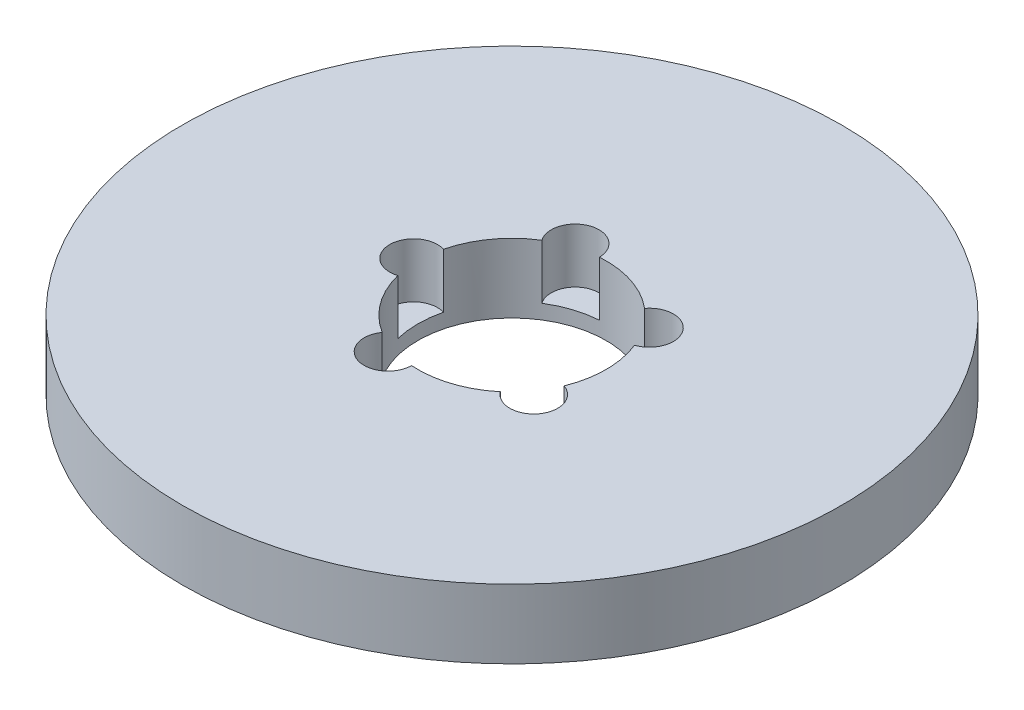
ISO-10303-21;
HEADER;
FILE_DESCRIPTION(('STEP AP214'),'2;1');
FILE_NAME('part.step','',(''),(''),'','','');
FILE_SCHEMA(('AUTOMOTIVE_DESIGN { 1 0 10303 214 1 1 1 1 }'));
ENDSEC;
DATA;
#1=APPLICATION_CONTEXT('core data for automotive mechanical design processes');
#2=APPLICATION_PROTOCOL_DEFINITION('international standard','automotive_design',2000,#1);
#3=PRODUCT_CONTEXT('',#1,'mechanical');
#4=PRODUCT('Part','Part','',(#3));
#5=PRODUCT_RELATED_PRODUCT_CATEGORY('part','',(#4));
#6=PRODUCT_DEFINITION_FORMATION('','',#4);
#7=PRODUCT_DEFINITION_CONTEXT('part definition',#1,'design');
#8=PRODUCT_DEFINITION('design','',#6,#7);
#9=PRODUCT_DEFINITION_SHAPE('','',#8);
#10=(LENGTH_UNIT() NAMED_UNIT(*) SI_UNIT(.MILLI.,.METRE.));
#11=(NAMED_UNIT(*) PLANE_ANGLE_UNIT() SI_UNIT($,.RADIAN.));
#12=(NAMED_UNIT(*) SI_UNIT($,.STERADIAN.) SOLID_ANGLE_UNIT());
#13=UNCERTAINTY_MEASURE_WITH_UNIT(LENGTH_MEASURE(1.E-05),#10,'distance_accuracy_value','');
#14=(GEOMETRIC_REPRESENTATION_CONTEXT(3) GLOBAL_UNCERTAINTY_ASSIGNED_CONTEXT((#13)) GLOBAL_UNIT_ASSIGNED_CONTEXT((#10,
#11,#12)) REPRESENTATION_CONTEXT('',''));
#15=CARTESIAN_POINT('',(0.,0.,0.));
#16=DIRECTION('',(0.,0.,1.));
#17=DIRECTION('',(1.,0.,0.));
#18=AXIS2_PLACEMENT_3D('',#15,#16,#17);
#19=CARTESIAN_POINT('',(0.,11.,0.));
#20=DIRECTION('',(0.,-1.,0.));
#21=DIRECTION('',(0.,0.,-1.));
#22=AXIS2_PLACEMENT_3D('',#19,#20,#21);
#23=CYLINDRICAL_SURFACE('',#22,52.5);
#24=CARTESIAN_POINT('',(0.,11.,0.));
#25=DIRECTION('',(0.,1.,0.));
#26=DIRECTION('',(0.,0.,1.));
#27=AXIS2_PLACEMENT_3D('',#24,#25,#26);
#28=CIRCLE('',#27,52.5);
#29=CARTESIAN_POINT('',(0.,11.,52.5));
#30=VERTEX_POINT('',#29);
#31=EDGE_CURVE('E157',#30,#30,#28,.T.);
#32=ORIENTED_EDGE('',*,*,#31,.F.);
#33=EDGE_LOOP('',(#32));
#34=FACE_BOUND('',#33,.T.);
#35=CARTESIAN_POINT('',(0.,0.,0.));
#36=DIRECTION('',(0.,1.,0.));
#37=DIRECTION('',(0.,0.,1.));
#38=AXIS2_PLACEMENT_3D('',#35,#36,#37);
#39=CIRCLE('',#38,52.5);
#40=CARTESIAN_POINT('',(0.,0.,52.5));
#41=VERTEX_POINT('',#40);
#42=EDGE_CURVE('E150',#41,#41,#39,.T.);
#43=ORIENTED_EDGE('',*,*,#42,.T.);
#44=EDGE_LOOP('',(#43));
#45=FACE_BOUND('',#44,.T.);
#46=ADVANCED_FACE('F39',(#34,#45),#23,.T.);
#47=CARTESIAN_POINT('',(0.,11.,0.));
#48=DIRECTION('',(0.,1.,0.));
#49=DIRECTION('',(0.,0.,1.));
#50=AXIS2_PLACEMENT_3D('',#47,#48,#49);
#51=PLANE('',#50);
#52=CARTESIAN_POINT('',(-4.84466939146573,11.,-14.9103592291704));
#53=DIRECTION('',(0.,1.,0.));
#54=DIRECTION('',(-0.95105651629515,0.,0.309016994374958));
#55=AXIS2_PLACEMENT_3D('',#52,#53,#54);
#56=CIRCLE('',#55,3.80865823341939);
#57=CARTESIAN_POINT('',(-1.03639107933771,11.,-14.9641536189211));
#58=VERTEX_POINT('',#57);
#59=CARTESIAN_POINT('',(-7.95725081423835,11.,-12.7154299761865));
#60=VERTEX_POINT('',#59);
#61=EDGE_CURVE('E194',#58,#60,#56,.T.);
#62=ORIENTED_EDGE('',*,*,#61,.F.);
#63=CARTESIAN_POINT('',(0.,11.,0.));
#64=DIRECTION('',(0.,1.,0.));
#65=DIRECTION('',(0.,0.,1.));
#66=AXIS2_PLACEMENT_3D('',#63,#64,#65);
#67=CIRCLE('',#66,15.);
#68=CARTESIAN_POINT('',(9.63416680624343,11.,-11.4970791921026));
#69=VERTEX_POINT('',#68);
#70=EDGE_CURVE('E147',#69,#58,#67,.T.);
#71=ORIENTED_EDGE('',*,*,#70,.F.);
#72=CARTESIAN_POINT('',(12.683509131113,11.,-9.2151087880981));
#73=DIRECTION('',(0.,1.,0.));
#74=DIRECTION('',(-0.58778525229248,0.,-0.809016994374942));
#75=AXIS2_PLACEMENT_3D('',#72,#73,#74);
#76=CIRCLE('',#75,3.80865823341939);
#77=CARTESIAN_POINT('',(13.9114933537827,11.,-5.60984426411824));
#78=VERTEX_POINT('',#77);
#79=EDGE_CURVE('E254',#78,#69,#76,.T.);
#80=ORIENTED_EDGE('',*,*,#79,.F.);
#81=CARTESIAN_POINT('',(13.9114933537828,11.,5.60984426411804));
#82=VERTEX_POINT('',#81);
#83=EDGE_CURVE('E144',#82,#78,#67,.T.);
#84=ORIENTED_EDGE('',*,*,#83,.F.);
#85=CARTESIAN_POINT('',(12.6835091311132,11.,9.21510878809792));
#86=DIRECTION('',(0.,1.,0.));
#87=DIRECTION('',(0.587785252292469,0.,-0.809016994374951));
#88=AXIS2_PLACEMENT_3D('',#85,#86,#87);
#89=CIRCLE('',#88,3.80865823341939);
#90=CARTESIAN_POINT('',(9.63416680624359,11.,11.4970791921024));
#91=VERTEX_POINT('',#90);
#92=EDGE_CURVE('E141',#91,#82,#89,.T.);
#93=ORIENTED_EDGE('',*,*,#92,.F.);
#94=CARTESIAN_POINT('',(-1.03639107933749,11.,14.9641536189211));
#95=VERTEX_POINT('',#94);
#96=EDGE_CURVE('E134',#95,#91,#67,.T.);
#97=ORIENTED_EDGE('',*,*,#96,.F.);
#98=CARTESIAN_POINT('',(-4.84466939146552,11.,14.9103592291704));
#99=DIRECTION('',(0.,1.,0.));
#100=DIRECTION('',(0.951056516295155,0.,0.309016994374945));
#101=AXIS2_PLACEMENT_3D('',#98,#99,#100);
#102=CIRCLE('',#101,3.80865823341939);
#103=CARTESIAN_POINT('',(-7.95725081423817,11.,12.7154299761867));
#104=VERTEX_POINT('',#103);
#105=EDGE_CURVE('E111',#104,#95,#102,.T.);
#106=ORIENTED_EDGE('',*,*,#105,.F.);
#107=CARTESIAN_POINT('',(-14.5520182664505,11.,3.63851128524986));
#108=VERTEX_POINT('',#107);
#109=EDGE_CURVE('E145',#108,#104,#67,.T.);
#110=ORIENTED_EDGE('',*,*,#109,.F.);
#111=CARTESIAN_POINT('',(-15.6776794792951,11.,0.));
#112=DIRECTION('',(0.,1.,0.));
#113=DIRECTION('',(0.,0.,1.));
#114=AXIS2_PLACEMENT_3D('',#111,#112,#113);
#115=CIRCLE('',#114,3.80865823341939);
#116=CARTESIAN_POINT('',(-14.5520182664505,11.,-3.63851128524986));
#117=VERTEX_POINT('',#116);
#118=EDGE_CURVE('E153',#117,#108,#115,.T.);
#119=ORIENTED_EDGE('',*,*,#118,.F.);
#120=EDGE_CURVE('E146',#60,#117,#67,.T.);
#121=ORIENTED_EDGE('',*,*,#120,.F.);
#122=EDGE_LOOP('',(#62,#71,#80,#84,#93,#97,#106,#110,#119,#121));
#123=FACE_BOUND('',#122,.T.);
#124=ORIENTED_EDGE('',*,*,#31,.T.);
#125=EDGE_LOOP('',(#124));
#126=FACE_BOUND('',#125,.T.);
#127=ADVANCED_FACE('F139',(#123,#126),#51,.T.);
#128=CARTESIAN_POINT('',(0.,0.,0.));
#129=DIRECTION('',(0.,1.,0.));
#130=DIRECTION('',(0.,0.,1.));
#131=AXIS2_PLACEMENT_3D('',#128,#129,#130);
#132=PLANE('',#131);
#133=CARTESIAN_POINT('',(0.,0.,0.));
#134=DIRECTION('',(0.,1.,0.));
#135=DIRECTION('',(0.,0.,1.));
#136=AXIS2_PLACEMENT_3D('',#133,#134,#135);
#137=CIRCLE('',#136,15.);
#138=CARTESIAN_POINT('',(0.,0.,15.));
#139=VERTEX_POINT('',#138);
#140=EDGE_CURVE('E154',#139,#139,#137,.T.);
#141=ORIENTED_EDGE('',*,*,#140,.T.);
#142=EDGE_LOOP('',(#141));
#143=FACE_BOUND('',#142,.T.);
#144=ORIENTED_EDGE('',*,*,#42,.F.);
#145=EDGE_LOOP('',(#144));
#146=FACE_BOUND('',#145,.T.);
#147=ADVANCED_FACE('F213',(#143,#146),#132,.F.);
#148=CARTESIAN_POINT('',(0.,11.,0.));
#149=DIRECTION('',(0.,-1.,0.));
#150=DIRECTION('',(0.,0.,-1.));
#151=AXIS2_PLACEMENT_3D('',#148,#149,#150);
#152=CYLINDRICAL_SURFACE('',#151,15.);
#153=DIRECTION('',(0.,1.,0.));
#154=VECTOR('',#153,1.);
#155=CARTESIAN_POINT('',(-1.03639107933771,6.65108886233761,-14.9641536189211));
#156=LINE('',#155,#154);
#157=CARTESIAN_POINT('',(-1.03639107933771,2.30217772467521,-14.9641536189211));
#158=VERTEX_POINT('',#157);
#159=EDGE_CURVE('E11',#158,#58,#156,.T.);
#160=ORIENTED_EDGE('',*,*,#159,.F.);
#161=CARTESIAN_POINT('',(0.,2.30217772467521,0.));
#162=DIRECTION('',(0.,1.,0.));
#163=DIRECTION('',(0.,0.,1.));
#164=AXIS2_PLACEMENT_3D('',#161,#162,#163);
#165=CIRCLE('',#164,15.);
#166=CARTESIAN_POINT('',(-7.95725081423835,2.30217772467521,-12.7154299761865));
#167=VERTEX_POINT('',#166);
#168=EDGE_CURVE('E189',#158,#167,#165,.T.);
#169=ORIENTED_EDGE('',*,*,#168,.T.);
#170=DIRECTION('',(0.,1.,0.));
#171=VECTOR('',#170,1.);
#172=CARTESIAN_POINT('',(-7.95725081423835,6.65108886233761,-12.7154299761865));
#173=LINE('',#172,#171);
#174=EDGE_CURVE('E46',#60,#167,#173,.F.);
#175=ORIENTED_EDGE('',*,*,#174,.F.);
#176=ORIENTED_EDGE('',*,*,#120,.T.);
#177=DIRECTION('',(0.,1.,0.));
#178=VECTOR('',#177,1.);
#179=CARTESIAN_POINT('',(-14.5520182664505,6.65108886233761,-3.63851128524986));
#180=LINE('',#179,#178);
#181=CARTESIAN_POINT('',(-14.5520182664505,2.30217772467521,-3.63851128524986));
#182=VERTEX_POINT('',#181);
#183=EDGE_CURVE('E168',#182,#117,#180,.T.);
#184=ORIENTED_EDGE('',*,*,#183,.F.);
#185=CARTESIAN_POINT('',(0.,2.30217772467521,0.));
#186=DIRECTION('',(0.,1.,0.));
#187=DIRECTION('',(0.,0.,1.));
#188=AXIS2_PLACEMENT_3D('',#185,#186,#187);
#189=CIRCLE('',#188,15.);
#190=CARTESIAN_POINT('',(-14.5520182664505,2.30217772467521,3.63851128524986));
#191=VERTEX_POINT('',#190);
#192=EDGE_CURVE('E165',#182,#191,#189,.T.);
#193=ORIENTED_EDGE('',*,*,#192,.T.);
#194=DIRECTION('',(0.,1.,0.));
#195=VECTOR('',#194,1.);
#196=CARTESIAN_POINT('',(-14.5520182664505,6.65108886233761,3.63851128524986));
#197=LINE('',#196,#195);
#198=EDGE_CURVE('E170',#108,#191,#197,.F.);
#199=ORIENTED_EDGE('',*,*,#198,.F.);
#200=ORIENTED_EDGE('',*,*,#109,.T.);
#201=DIRECTION('',(0.,1.,0.));
#202=VECTOR('',#201,1.);
#203=CARTESIAN_POINT('',(-7.95725081423817,6.65108886233761,12.7154299761867));
#204=LINE('',#203,#202);
#205=CARTESIAN_POINT('',(-7.95725081423817,2.30217772467521,12.7154299761867));
#206=VERTEX_POINT('',#205);
#207=EDGE_CURVE('E121',#206,#104,#204,.T.);
#208=ORIENTED_EDGE('',*,*,#207,.F.);
#209=CARTESIAN_POINT('',(0.,2.30217772467521,0.));
#210=DIRECTION('',(0.,1.,0.));
#211=DIRECTION('',(0.,0.,1.));
#212=AXIS2_PLACEMENT_3D('',#209,#210,#211);
#213=CIRCLE('',#212,15.);
#214=CARTESIAN_POINT('',(-1.03639107933749,2.30217772467521,14.9641536189211));
#215=VERTEX_POINT('',#214);
#216=EDGE_CURVE('E136',#206,#215,#213,.T.);
#217=ORIENTED_EDGE('',*,*,#216,.T.);
#218=DIRECTION('',(0.,1.,0.));
#219=VECTOR('',#218,1.);
#220=CARTESIAN_POINT('',(-1.03639107933749,6.65108886233761,14.9641536189211));
#221=LINE('',#220,#219);
#222=EDGE_CURVE('E117',#95,#215,#221,.F.);
#223=ORIENTED_EDGE('',*,*,#222,.F.);
#224=ORIENTED_EDGE('',*,*,#96,.T.);
#225=DIRECTION('',(0.,1.,0.));
#226=VECTOR('',#225,1.);
#227=CARTESIAN_POINT('',(9.63416680624359,6.65108886233761,11.4970791921024));
#228=LINE('',#227,#226);
#229=CARTESIAN_POINT('',(9.63416680624359,2.30217772467521,11.4970791921024));
#230=VERTEX_POINT('',#229);
#231=EDGE_CURVE('E182',#230,#91,#228,.T.);
#232=ORIENTED_EDGE('',*,*,#231,.F.);
#233=CARTESIAN_POINT('',(0.,2.30217772467521,0.));
#234=DIRECTION('',(0.,1.,0.));
#235=DIRECTION('',(0.,0.,1.));
#236=AXIS2_PLACEMENT_3D('',#233,#234,#235);
#237=CIRCLE('',#236,15.);
#238=CARTESIAN_POINT('',(13.9114933537828,2.30217772467521,5.60984426411804));
#239=VERTEX_POINT('',#238);
#240=EDGE_CURVE('E174',#230,#239,#237,.T.);
#241=ORIENTED_EDGE('',*,*,#240,.T.);
#242=DIRECTION('',(0.,1.,0.));
#243=VECTOR('',#242,1.);
#244=CARTESIAN_POINT('',(13.9114933537828,6.65108886233761,5.60984426411804));
#245=LINE('',#244,#243);
#246=EDGE_CURVE('E177',#82,#239,#245,.F.);
#247=ORIENTED_EDGE('',*,*,#246,.F.);
#248=ORIENTED_EDGE('',*,*,#83,.T.);
#249=DIRECTION('',(0.,1.,0.));
#250=VECTOR('',#249,1.);
#251=CARTESIAN_POINT('',(13.9114933537827,6.65108886233761,-5.60984426411824));
#252=LINE('',#251,#250);
#253=CARTESIAN_POINT('',(13.9114933537827,2.30217772467521,-5.60984426411824));
#254=VERTEX_POINT('',#253);
#255=EDGE_CURVE('E187',#254,#78,#252,.T.);
#256=ORIENTED_EDGE('',*,*,#255,.F.);
#257=CARTESIAN_POINT('',(0.,2.30217772467521,0.));
#258=DIRECTION('',(0.,1.,0.));
#259=DIRECTION('',(0.,0.,1.));
#260=AXIS2_PLACEMENT_3D('',#257,#258,#259);
#261=CIRCLE('',#260,15.);
#262=CARTESIAN_POINT('',(9.63416680624343,2.30217772467521,-11.4970791921026));
#263=VERTEX_POINT('',#262);
#264=EDGE_CURVE('E181',#254,#263,#261,.T.);
#265=ORIENTED_EDGE('',*,*,#264,.T.);
#266=DIRECTION('',(0.,1.,0.));
#267=VECTOR('',#266,1.);
#268=CARTESIAN_POINT('',(9.63416680624343,6.65108886233761,-11.4970791921025));
#269=LINE('',#268,#267);
#270=EDGE_CURVE('E186',#69,#263,#269,.F.);
#271=ORIENTED_EDGE('',*,*,#270,.F.);
#272=ORIENTED_EDGE('',*,*,#70,.T.);
#273=EDGE_LOOP('',(#160,#169,#175,#176,#184,#193,#199,#200,#208,#217,#223,#224,#232,#241,#247,
#248,#256,#265,#271,#272));
#274=FACE_BOUND('',#273,.T.);
#275=ORIENTED_EDGE('',*,*,#140,.F.);
#276=EDGE_LOOP('',(#275));
#277=FACE_BOUND('',#276,.T.);
#278=ADVANCED_FACE('F135',(#274,#277),#152,.F.);
#279=CARTESIAN_POINT('',(-15.6776794792951,2.30217772467521,0.));
#280=DIRECTION('',(0.,1.,0.));
#281=DIRECTION('',(0.,0.,1.));
#282=AXIS2_PLACEMENT_3D('',#279,#280,#281);
#283=CYLINDRICAL_SURFACE('',#282,3.80865823341939);
#284=ORIENTED_EDGE('',*,*,#183,.T.);
#285=ORIENTED_EDGE('',*,*,#118,.T.);
#286=ORIENTED_EDGE('',*,*,#198,.T.);
#287=CARTESIAN_POINT('',(-15.6776794792951,2.30217772467521,0.));
#288=DIRECTION('',(0.,1.,0.));
#289=DIRECTION('',(0.,0.,1.));
#290=AXIS2_PLACEMENT_3D('',#287,#288,#289);
#291=CIRCLE('',#290,3.80865823341939);
#292=EDGE_CURVE('E158',#182,#191,#291,.T.);
#293=ORIENTED_EDGE('',*,*,#292,.F.);
#294=EDGE_LOOP('',(#284,#285,#286,#293));
#295=FACE_BOUND('',#294,.T.);
#296=ADVANCED_FACE('F221',(#295),#283,.F.);
#297=CARTESIAN_POINT('',(-15.6776794792951,2.30217772467521,0.));
#298=DIRECTION('',(0.,1.,0.));
#299=DIRECTION('',(0.,0.,1.));
#300=AXIS2_PLACEMENT_3D('',#297,#298,#299);
#301=PLANE('',#300);
#302=ORIENTED_EDGE('',*,*,#292,.T.);
#303=ORIENTED_EDGE('',*,*,#192,.F.);
#304=EDGE_LOOP('',(#302,#303));
#305=FACE_BOUND('',#304,.T.);
#306=ADVANCED_FACE('F227',(#305),#301,.T.);
#307=CARTESIAN_POINT('',(-4.84466939146552,2.30217772467521,14.9103592291704));
#308=DIRECTION('',(0.,1.,0.));
#309=DIRECTION('',(0.,0.,1.));
#310=AXIS2_PLACEMENT_3D('',#307,#308,#309);
#311=CYLINDRICAL_SURFACE('',#310,3.80865823341939);
#312=ORIENTED_EDGE('',*,*,#207,.T.);
#313=ORIENTED_EDGE('',*,*,#105,.T.);
#314=ORIENTED_EDGE('',*,*,#222,.T.);
#315=CARTESIAN_POINT('',(-4.84466939146552,2.30217772467521,14.9103592291704));
#316=DIRECTION('',(0.,1.,0.));
#317=DIRECTION('',(0.951056516295155,0.,0.309016994374945));
#318=AXIS2_PLACEMENT_3D('',#315,#316,#317);
#319=CIRCLE('',#318,3.80865823341939);
#320=EDGE_CURVE('E127',#206,#215,#319,.T.);
#321=ORIENTED_EDGE('',*,*,#320,.F.);
#322=EDGE_LOOP('',(#312,#313,#314,#321));
#323=FACE_BOUND('',#322,.T.);
#324=ADVANCED_FACE('F116',(#323),#311,.F.);
#325=CARTESIAN_POINT('',(-4.84466939146552,2.30217772467521,14.9103592291704));
#326=DIRECTION('',(0.,1.,0.));
#327=DIRECTION('',(0.951056516295155,0.,0.309016994374945));
#328=AXIS2_PLACEMENT_3D('',#325,#326,#327);
#329=PLANE('',#328);
#330=ORIENTED_EDGE('',*,*,#320,.T.);
#331=ORIENTED_EDGE('',*,*,#216,.F.);
#332=EDGE_LOOP('',(#330,#331));
#333=FACE_BOUND('',#332,.T.);
#334=ADVANCED_FACE('F234',(#333),#329,.T.);
#335=CARTESIAN_POINT('',(12.6835091311132,2.30217772467521,9.21510878809792));
#336=DIRECTION('',(0.,1.,0.));
#337=DIRECTION('',(0.,0.,1.));
#338=AXIS2_PLACEMENT_3D('',#335,#336,#337);
#339=CYLINDRICAL_SURFACE('',#338,3.80865823341939);
#340=ORIENTED_EDGE('',*,*,#231,.T.);
#341=ORIENTED_EDGE('',*,*,#92,.T.);
#342=ORIENTED_EDGE('',*,*,#246,.T.);
#343=CARTESIAN_POINT('',(12.6835091311132,2.30217772467521,9.21510878809792));
#344=DIRECTION('',(0.,1.,0.));
#345=DIRECTION('',(0.587785252292469,0.,-0.809016994374951));
#346=AXIS2_PLACEMENT_3D('',#343,#344,#345);
#347=CIRCLE('',#346,3.80865823341939);
#348=EDGE_CURVE('E130',#230,#239,#347,.T.);
#349=ORIENTED_EDGE('',*,*,#348,.F.);
#350=EDGE_LOOP('',(#340,#341,#342,#349));
#351=FACE_BOUND('',#350,.T.);
#352=ADVANCED_FACE('F240',(#351),#339,.F.);
#353=CARTESIAN_POINT('',(12.6835091311132,2.30217772467521,9.21510878809792));
#354=DIRECTION('',(0.,1.,0.));
#355=DIRECTION('',(0.587785252292469,0.,-0.809016994374951));
#356=AXIS2_PLACEMENT_3D('',#353,#354,#355);
#357=PLANE('',#356);
#358=ORIENTED_EDGE('',*,*,#348,.T.);
#359=ORIENTED_EDGE('',*,*,#240,.F.);
#360=EDGE_LOOP('',(#358,#359));
#361=FACE_BOUND('',#360,.T.);
#362=ADVANCED_FACE('F245',(#361),#357,.T.);
#363=CARTESIAN_POINT('',(12.683509131113,2.30217772467521,-9.2151087880981));
#364=DIRECTION('',(0.,1.,0.));
#365=DIRECTION('',(0.,0.,1.));
#366=AXIS2_PLACEMENT_3D('',#363,#364,#365);
#367=CYLINDRICAL_SURFACE('',#366,3.80865823341939);
#368=ORIENTED_EDGE('',*,*,#255,.T.);
#369=ORIENTED_EDGE('',*,*,#79,.T.);
#370=ORIENTED_EDGE('',*,*,#270,.T.);
#371=CARTESIAN_POINT('',(12.683509131113,2.30217772467521,-9.2151087880981));
#372=DIRECTION('',(0.,1.,0.));
#373=DIRECTION('',(-0.58778525229248,0.,-0.809016994374942));
#374=AXIS2_PLACEMENT_3D('',#371,#372,#373);
#375=CIRCLE('',#374,3.80865823341939);
#376=EDGE_CURVE('E56',#254,#263,#375,.T.);
#377=ORIENTED_EDGE('',*,*,#376,.F.);
#378=EDGE_LOOP('',(#368,#369,#370,#377));
#379=FACE_BOUND('',#378,.T.);
#380=ADVANCED_FACE('F266',(#379),#367,.F.);
#381=CARTESIAN_POINT('',(12.683509131113,2.30217772467521,-9.2151087880981));
#382=DIRECTION('',(0.,1.,0.));
#383=DIRECTION('',(-0.58778525229248,0.,-0.809016994374942));
#384=AXIS2_PLACEMENT_3D('',#381,#382,#383);
#385=PLANE('',#384);
#386=ORIENTED_EDGE('',*,*,#376,.T.);
#387=ORIENTED_EDGE('',*,*,#264,.F.);
#388=EDGE_LOOP('',(#386,#387));
#389=FACE_BOUND('',#388,.T.);
#390=ADVANCED_FACE('F204',(#389),#385,.T.);
#391=CARTESIAN_POINT('',(-4.84466939146573,2.30217772467521,-14.9103592291704));
#392=DIRECTION('',(0.,1.,0.));
#393=DIRECTION('',(0.,0.,1.));
#394=AXIS2_PLACEMENT_3D('',#391,#392,#393);
#395=CYLINDRICAL_SURFACE('',#394,3.80865823341939);
#396=ORIENTED_EDGE('',*,*,#159,.T.);
#397=ORIENTED_EDGE('',*,*,#61,.T.);
#398=ORIENTED_EDGE('',*,*,#174,.T.);
#399=CARTESIAN_POINT('',(-4.84466939146573,2.30217772467521,-14.9103592291704));
#400=DIRECTION('',(0.,1.,0.));
#401=DIRECTION('',(-0.95105651629515,0.,0.309016994374958));
#402=AXIS2_PLACEMENT_3D('',#399,#400,#401);
#403=CIRCLE('',#402,3.80865823341939);
#404=EDGE_CURVE('E55',#158,#167,#403,.T.);
#405=ORIENTED_EDGE('',*,*,#404,.F.);
#406=EDGE_LOOP('',(#396,#397,#398,#405));
#407=FACE_BOUND('',#406,.T.);
#408=ADVANCED_FACE('F193',(#407),#395,.F.);
#409=CARTESIAN_POINT('',(-4.84466939146573,2.30217772467521,-14.9103592291704));
#410=DIRECTION('',(0.,1.,0.));
#411=DIRECTION('',(-0.95105651629515,0.,0.309016994374958));
#412=AXIS2_PLACEMENT_3D('',#409,#410,#411);
#413=PLANE('',#412);
#414=ORIENTED_EDGE('',*,*,#404,.T.);
#415=ORIENTED_EDGE('',*,*,#168,.F.);
#416=EDGE_LOOP('',(#414,#415));
#417=FACE_BOUND('',#416,.T.);
#418=ADVANCED_FACE('F196',(#417),#413,.T.);
#419=CLOSED_SHELL('',(#46,#127,#147,#278,#296,#306,#324,#334,#352,#362,#380,#390,#408,#418));
#420=MANIFOLD_SOLID_BREP('B2',#419);
#421=ADVANCED_BREP_SHAPE_REPRESENTATION('',(#18,#420),#14);
#422=SHAPE_DEFINITION_REPRESENTATION(#9,#421);
ENDSEC;
END-ISO-10303-21;
